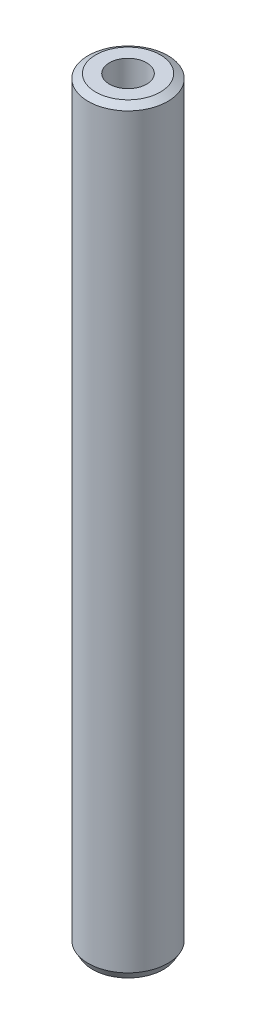
ISO-10303-21;
HEADER;
FILE_DESCRIPTION(('STEP AP214'),'2;1');
FILE_NAME('part.step','',(''),(''),'','','');
FILE_SCHEMA(('AUTOMOTIVE_DESIGN { 1 0 10303 214 1 1 1 1 }'));
ENDSEC;
DATA;
#1=APPLICATION_CONTEXT('core data for automotive mechanical design processes');
#2=APPLICATION_PROTOCOL_DEFINITION('international standard','automotive_design',2000,#1);
#3=PRODUCT_CONTEXT('',#1,'mechanical');
#4=PRODUCT('Part','Part','',(#3));
#5=PRODUCT_RELATED_PRODUCT_CATEGORY('part','',(#4));
#6=PRODUCT_DEFINITION_FORMATION('','',#4);
#7=PRODUCT_DEFINITION_CONTEXT('part definition',#1,'design');
#8=PRODUCT_DEFINITION('design','',#6,#7);
#9=PRODUCT_DEFINITION_SHAPE('','',#8);
#10=(LENGTH_UNIT() NAMED_UNIT(*) SI_UNIT(.MILLI.,.METRE.));
#11=(NAMED_UNIT(*) PLANE_ANGLE_UNIT() SI_UNIT($,.RADIAN.));
#12=(NAMED_UNIT(*) SI_UNIT($,.STERADIAN.) SOLID_ANGLE_UNIT());
#13=UNCERTAINTY_MEASURE_WITH_UNIT(LENGTH_MEASURE(1.E-05),#10,'distance_accuracy_value','');
#14=(GEOMETRIC_REPRESENTATION_CONTEXT(3) GLOBAL_UNCERTAINTY_ASSIGNED_CONTEXT((#13)) GLOBAL_UNIT_ASSIGNED_CONTEXT((#10,
#11,#12)) REPRESENTATION_CONTEXT('',''));
#15=CARTESIAN_POINT('',(0.,0.,0.));
#16=DIRECTION('',(0.,0.,1.));
#17=DIRECTION('',(1.,0.,0.));
#18=AXIS2_PLACEMENT_3D('',#15,#16,#17);
#19=CARTESIAN_POINT('',(0.,428.811424189461,0.));
#20=DIRECTION('',(0.,-1.,0.));
#21=DIRECTION('',(0.,0.,-1.));
#22=AXIS2_PLACEMENT_3D('',#19,#20,#21);
#23=CYLINDRICAL_SURFACE('',#22,22.5);
#24=CARTESIAN_POINT('',(0.,426.365814869016,0.));
#25=DIRECTION('',(0.,1.,0.));
#26=DIRECTION('',(0.,0.,1.));
#27=AXIS2_PLACEMENT_3D('',#24,#25,#26);
#28=CIRCLE('',#27,22.5);
#29=CARTESIAN_POINT('',(0.,426.365814869016,-22.5));
#30=VERTEX_POINT('',#29);
#31=EDGE_CURVE('E50',#30,#30,#28,.F.);
#32=CARTESIAN_POINT('',(0.,4.23591959847641,0.));
#33=DIRECTION('',(0.,1.,0.));
#34=DIRECTION('',(0.,0.,1.));
#35=AXIS2_PLACEMENT_3D('',#32,#33,#34);
#36=CIRCLE('',#35,22.5);
#37=CARTESIAN_POINT('',(0.,4.23591959847641,-22.5));
#38=VERTEX_POINT('',#37);
#39=EDGE_CURVE('E51',#38,#38,#36,.T.);
#40=CARTESIAN_POINT('',(0.,426.365814869016,-22.5));
#41=CARTESIAN_POINT('',(0.,421.968628459947,-22.5));
#42=CARTESIAN_POINT('',(0.,417.571442050879,-22.5));
#43=CARTESIAN_POINT('',(0.,408.777069232743,-22.5));
#44=CARTESIAN_POINT('',(0.,404.379882823675,-22.5));
#45=CARTESIAN_POINT('',(0.,395.585510005539,-22.5));
#46=CARTESIAN_POINT('',(0.,391.188323596471,-22.5));
#47=CARTESIAN_POINT('',(0.,382.393950778334,-22.5));
#48=CARTESIAN_POINT('',(0.,377.996764369266,-22.5));
#49=CARTESIAN_POINT('',(0.,369.20239155113,-22.5));
#50=CARTESIAN_POINT('',(0.,364.805205142062,-22.5));
#51=CARTESIAN_POINT('',(0.,356.010832323926,-22.5));
#52=CARTESIAN_POINT('',(0.,351.613645914858,-22.5));
#53=CARTESIAN_POINT('',(0.,342.819273096721,-22.5));
#54=CARTESIAN_POINT('',(0.,338.422086687653,-22.5));
#55=CARTESIAN_POINT('',(0.,329.627713869517,-22.5));
#56=CARTESIAN_POINT('',(0.,325.230527460449,-22.5));
#57=CARTESIAN_POINT('',(0.,316.436154642313,-22.5));
#58=CARTESIAN_POINT('',(0.,312.038968233245,-22.5));
#59=CARTESIAN_POINT('',(0.,303.244595415108,-22.5));
#60=CARTESIAN_POINT('',(0.,298.84740900604,-22.5));
#61=CARTESIAN_POINT('',(0.,290.053036187904,-22.5));
#62=CARTESIAN_POINT('',(0.,285.655849778836,-22.5));
#63=CARTESIAN_POINT('',(0.,276.8614769607,-22.5));
#64=CARTESIAN_POINT('',(0.,272.464290551632,-22.5));
#65=CARTESIAN_POINT('',(0.,263.669917733495,-22.5));
#66=CARTESIAN_POINT('',(0.,259.272731324427,-22.5));
#67=CARTESIAN_POINT('',(0.,250.478358506291,-22.5));
#68=CARTESIAN_POINT('',(0.,246.081172097223,-22.5));
#69=CARTESIAN_POINT('',(0.,237.286799279087,-22.5));
#70=CARTESIAN_POINT('',(0.,232.889612870018,-22.5));
#71=CARTESIAN_POINT('',(0.,224.095240051882,-22.5));
#72=CARTESIAN_POINT('',(0.,219.698053642814,-22.5));
#73=CARTESIAN_POINT('',(0.,210.903680824678,-22.5));
#74=CARTESIAN_POINT('',(0.,206.50649441561,-22.5));
#75=CARTESIAN_POINT('',(0.,197.712121597474,-22.5));
#76=CARTESIAN_POINT('',(0.,193.314935188405,-22.5));
#77=CARTESIAN_POINT('',(0.,184.520562370269,-22.5));
#78=CARTESIAN_POINT('',(0.,180.123375961201,-22.5));
#79=CARTESIAN_POINT('',(0.,171.329003143065,-22.5));
#80=CARTESIAN_POINT('',(0.,166.931816733997,-22.5));
#81=CARTESIAN_POINT('',(0.,158.137443915861,-22.5));
#82=CARTESIAN_POINT('',(0.,153.740257506792,-22.5));
#83=CARTESIAN_POINT('',(0.,144.945884688656,-22.5));
#84=CARTESIAN_POINT('',(0.,140.548698279588,-22.5));
#85=CARTESIAN_POINT('',(0.,131.754325461452,-22.5));
#86=CARTESIAN_POINT('',(0.,127.357139052384,-22.5));
#87=CARTESIAN_POINT('',(0.,118.562766234247,-22.5));
#88=CARTESIAN_POINT('',(0.,114.165579825179,-22.5));
#89=CARTESIAN_POINT('',(0.,105.371207007043,-22.5));
#90=CARTESIAN_POINT('',(0.,100.974020597975,-22.5));
#91=CARTESIAN_POINT('',(0.,92.1796477798387,-22.5));
#92=CARTESIAN_POINT('',(0.,87.7824613707706,-22.5));
#93=CARTESIAN_POINT('',(0.,78.9880885526344,-22.5));
#94=CARTESIAN_POINT('',(0.,74.5909021435663,-22.5));
#95=CARTESIAN_POINT('',(0.,65.79652932543,-22.5));
#96=CARTESIAN_POINT('',(0.,61.3993429163619,-22.5));
#97=CARTESIAN_POINT('',(0.,52.6049700982257,-22.5));
#98=CARTESIAN_POINT('',(0.,48.2077836891576,-22.5));
#99=CARTESIAN_POINT('',(0.,39.4134108710213,-22.5));
#100=CARTESIAN_POINT('',(0.,35.0162244619532,-22.5));
#101=CARTESIAN_POINT('',(0.,26.221851643817,-22.5));
#102=CARTESIAN_POINT('',(0.,21.8246652347489,-22.5));
#103=CARTESIAN_POINT('',(0.,13.0302924166126,-22.5));
#104=CARTESIAN_POINT('',(0.,8.63310600754451,-22.5));
#105=CARTESIAN_POINT('',(0.,4.23591959847641,-22.5));
#106=B_SPLINE_CURVE_WITH_KNOTS('',3,(#40,#41,#42,#43,#44,#45,#46,#47,#48,#49,#50,#51,#52,#53,
#54,#55,#56,#57,#58,#59,#60,#61,#62,#63,#64,#65,#66,#67,#68,#69,#70,#71,#72,#73,#74,#75,#76,#77,
#78,#79,#80,#81,#82,#83,#84,#85,#86,#87,#88,#89,#90,#91,#92,#93,#94,#95,#96,#97,#98,#99,#100,
#101,#102,#103,#104,#105),.UNSPECIFIED.,.F.,.F.,(4,2,2,2,2,2,2,2,2,2,2,2,2,2,2,2,2,2,2,2,2,2,2,
2,2,2,2,2,2,2,2,2,4),(0.,13.1915592272043,26.3831184544087,39.574677681613,52.7662369088174,
65.9577961360217,79.149355363226,92.3409145904304,105.532473817635,118.724033044839,
131.915592272043,145.107151499248,158.298710726452,171.490269953657,184.681829180861,
197.873388408065,211.06494763527,224.256506862474,237.448066089678,250.639625316883,
263.831184544087,277.022743771291,290.214302998496,303.4058622257,316.597421452904,
329.788980680109,342.980539907313,356.172099134517,369.363658361722,382.555217588926,
395.74677681613,408.938336043335,422.129895270539),.UNSPECIFIED.);
#107=EDGE_CURVE('BSEAM39',#30,#38,#106,.T.);
#108=ORIENTED_EDGE('',*,*,#31,.T.);
#109=ORIENTED_EDGE('',*,*,#39,.T.);
#110=ORIENTED_EDGE('',*,*,#107,.T.);
#111=ORIENTED_EDGE('',*,*,#107,.F.);
#112=EDGE_LOOP('',(#108,#110,#109,#111));
#113=FACE_BOUND('',#112,.T.);
#114=ADVANCED_FACE('F39',(#113),#23,.T.);
#115=CARTESIAN_POINT('',(0.,428.811424189461,0.));
#116=DIRECTION('',(0.,1.,0.));
#117=DIRECTION('',(0.,0.,1.));
#118=AXIS2_PLACEMENT_3D('',#115,#116,#117);
#119=PLANE('',#118);
#120=CARTESIAN_POINT('',(0.,428.811424189461,0.));
#121=DIRECTION('',(0.,1.,0.));
#122=DIRECTION('',(0.,0.,1.));
#123=AXIS2_PLACEMENT_3D('',#120,#121,#122);
#124=CIRCLE('',#123,18.2640804015243);
#125=CARTESIAN_POINT('',(0.,428.811424189461,18.2640804015243));
#126=VERTEX_POINT('',#125);
#127=EDGE_CURVE('E54',#126,#126,#124,.T.);
#128=ORIENTED_EDGE('',*,*,#127,.T.);
#129=EDGE_LOOP('',(#128));
#130=FACE_BOUND('',#129,.T.);
#131=CARTESIAN_POINT('',(0.,428.811424189461,0.));
#132=DIRECTION('',(0.,1.,0.));
#133=DIRECTION('',(0.,0.,1.));
#134=AXIS2_PLACEMENT_3D('',#131,#132,#133);
#135=CIRCLE('',#134,10.5264777317819);
#136=CARTESIAN_POINT('',(0.,428.811424189461,-10.5264777317819));
#137=VERTEX_POINT('',#136);
#138=EDGE_CURVE('E58',#137,#137,#135,.T.);
#139=ORIENTED_EDGE('',*,*,#138,.F.);
#140=EDGE_LOOP('',(#139));
#141=FACE_BOUND('',#140,.T.);
#142=ADVANCED_FACE('F69',(#130,#141),#119,.T.);
#143=CARTESIAN_POINT('',(0.,0.,0.));
#144=DIRECTION('',(0.,1.,0.));
#145=DIRECTION('',(0.,0.,1.));
#146=AXIS2_PLACEMENT_3D('',#143,#144,#145);
#147=PLANE('',#146);
#148=CARTESIAN_POINT('',(0.,0.,0.));
#149=DIRECTION('',(0.,1.,0.));
#150=DIRECTION('',(0.,0.,1.));
#151=AXIS2_PLACEMENT_3D('',#148,#149,#150);
#152=CIRCLE('',#151,20.054390679554);
#153=CARTESIAN_POINT('',(0.,0.,20.054390679554));
#154=VERTEX_POINT('',#153);
#155=EDGE_CURVE('E10',#154,#154,#152,.F.);
#156=ORIENTED_EDGE('',*,*,#155,.T.);
#157=EDGE_LOOP('',(#156));
#158=FACE_BOUND('',#157,.T.);
#159=CARTESIAN_POINT('',(0.,0.,0.));
#160=DIRECTION('',(0.,1.,0.));
#161=DIRECTION('',(0.,0.,1.));
#162=AXIS2_PLACEMENT_3D('',#159,#160,#161);
#163=CIRCLE('',#162,10.5264777317819);
#164=CARTESIAN_POINT('',(0.,0.,-10.5264777317819));
#165=VERTEX_POINT('',#164);
#166=EDGE_CURVE('E63',#165,#165,#163,.T.);
#167=ORIENTED_EDGE('',*,*,#166,.T.);
#168=EDGE_LOOP('',(#167));
#169=FACE_BOUND('',#168,.T.);
#170=ADVANCED_FACE('F75',(#158,#169),#147,.F.);
#171=CARTESIAN_POINT('',(0.,428.811424189461,0.));
#172=DIRECTION('',(0.,-1.,0.));
#173=DIRECTION('',(0.,0.,-1.));
#174=AXIS2_PLACEMENT_3D('',#171,#172,#173);
#175=CYLINDRICAL_SURFACE('',#174,10.5264777317819);
#176=CARTESIAN_POINT('',(0.,428.811424189461,-10.5264777317819));
#177=CARTESIAN_POINT('',(0.,424.344638520821,-10.5264777317819));
#178=CARTESIAN_POINT('',(0.,419.877852852181,-10.5264777317819));
#179=CARTESIAN_POINT('',(0.,410.9442815149,-10.5264777317819));
#180=CARTESIAN_POINT('',(0.,406.47749584626,-10.5264777317819));
#181=CARTESIAN_POINT('',(0.,397.54392450898,-10.5264777317819));
#182=CARTESIAN_POINT('',(0.,393.077138840339,-10.5264777317819));
#183=CARTESIAN_POINT('',(0.,384.143567503059,-10.5264777317819));
#184=CARTESIAN_POINT('',(0.,379.676781834419,-10.5264777317819));
#185=CARTESIAN_POINT('',(0.,370.743210497138,-10.5264777317819));
#186=CARTESIAN_POINT('',(0.,366.276424828498,-10.5264777317819));
#187=CARTESIAN_POINT('',(0.,357.342853491218,-10.5264777317819));
#188=CARTESIAN_POINT('',(0.,352.876067822577,-10.5264777317819));
#189=CARTESIAN_POINT('',(0.,343.942496485297,-10.5264777317819));
#190=CARTESIAN_POINT('',(0.,339.475710816657,-10.5264777317819));
#191=CARTESIAN_POINT('',(0.,330.542139479376,-10.5264777317819));
#192=CARTESIAN_POINT('',(0.,326.075353810736,-10.5264777317819));
#193=CARTESIAN_POINT('',(0.,317.141782473456,-10.5264777317819));
#194=CARTESIAN_POINT('',(0.,312.674996804815,-10.5264777317819));
#195=CARTESIAN_POINT('',(0.,303.741425467535,-10.5264777317819));
#196=CARTESIAN_POINT('',(0.,299.274639798895,-10.5264777317819));
#197=CARTESIAN_POINT('',(0.,290.341068461614,-10.5264777317819));
#198=CARTESIAN_POINT('',(0.,285.874282792974,-10.5264777317819));
#199=CARTESIAN_POINT('',(0.,276.940711455694,-10.5264777317819));
#200=CARTESIAN_POINT('',(0.,272.473925787053,-10.5264777317819));
#201=CARTESIAN_POINT('',(0.,263.540354449773,-10.5264777317819));
#202=CARTESIAN_POINT('',(0.,259.073568781133,-10.5264777317819));
#203=CARTESIAN_POINT('',(0.,250.139997443852,-10.5264777317819));
#204=CARTESIAN_POINT('',(0.,245.673211775212,-10.5264777317819));
#205=CARTESIAN_POINT('',(0.,236.739640437932,-10.5264777317819));
#206=CARTESIAN_POINT('',(0.,232.272854769291,-10.5264777317819));
#207=CARTESIAN_POINT('',(0.,223.339283432011,-10.5264777317819));
#208=CARTESIAN_POINT('',(0.,218.872497763371,-10.5264777317819));
#209=CARTESIAN_POINT('',(0.,209.93892642609,-10.5264777317819));
#210=CARTESIAN_POINT('',(0.,205.47214075745,-10.5264777317819));
#211=CARTESIAN_POINT('',(0.,196.53856942017,-10.5264777317819));
#212=CARTESIAN_POINT('',(0.,192.071783751529,-10.5264777317819));
#213=CARTESIAN_POINT('',(0.,183.138212414249,-10.5264777317819));
#214=CARTESIAN_POINT('',(0.,178.671426745609,-10.5264777317819));
#215=CARTESIAN_POINT('',(0.,169.737855408328,-10.5264777317819));
#216=CARTESIAN_POINT('',(0.,165.271069739688,-10.5264777317819));
#217=CARTESIAN_POINT('',(0.,156.337498402408,-10.5264777317819));
#218=CARTESIAN_POINT('',(0.,151.870712733767,-10.5264777317819));
#219=CARTESIAN_POINT('',(0.,142.937141396487,-10.5264777317819));
#220=CARTESIAN_POINT('',(0.,138.470355727847,-10.5264777317819));
#221=CARTESIAN_POINT('',(0.,129.536784390566,-10.5264777317819));
#222=CARTESIAN_POINT('',(0.,125.069998721926,-10.5264777317819));
#223=CARTESIAN_POINT('',(0.,116.136427384646,-10.5264777317819));
#224=CARTESIAN_POINT('',(0.,111.669641716006,-10.5264777317819));
#225=CARTESIAN_POINT('',(0.,102.736070378725,-10.5264777317819));
#226=CARTESIAN_POINT('',(0.,98.2692847100848,-10.5264777317819));
#227=CARTESIAN_POINT('',(0.,89.3357133728044,-10.5264777317819));
#228=CARTESIAN_POINT('',(0.,84.8689277041642,-10.5264777317819));
#229=CARTESIAN_POINT('',(0.,75.9353563668837,-10.5264777317819));
#230=CARTESIAN_POINT('',(0.,71.4685706982435,-10.5264777317819));
#231=CARTESIAN_POINT('',(0.,62.534999360963,-10.5264777317819));
#232=CARTESIAN_POINT('',(0.,58.0682136923228,-10.5264777317819));
#233=CARTESIAN_POINT('',(0.,49.1346423550424,-10.5264777317819));
#234=CARTESIAN_POINT('',(0.,44.6678566864022,-10.5264777317819));
#235=CARTESIAN_POINT('',(0.,35.7342853491217,-10.5264777317819));
#236=CARTESIAN_POINT('',(0.,31.2674996804815,-10.5264777317819));
#237=CARTESIAN_POINT('',(0.,22.333928343201,-10.5264777317819));
#238=CARTESIAN_POINT('',(0.,17.8671426745608,-10.5264777317819));
#239=CARTESIAN_POINT('',(0.,8.9335713372804,-10.5264777317819));
#240=CARTESIAN_POINT('',(0.,4.46678566864017,-10.5264777317819));
#241=CARTESIAN_POINT('',(0.,0.,-10.5264777317819));
#242=B_SPLINE_CURVE_WITH_KNOTS('',3,(#176,#177,#178,#179,#180,#181,#182,#183,#184,#185,#186,
#187,#188,#189,#190,#191,#192,#193,#194,#195,#196,#197,#198,#199,#200,#201,#202,#203,#204,#205,
#206,#207,#208,#209,#210,#211,#212,#213,#214,#215,#216,#217,#218,#219,#220,#221,#222,#223,#224,
#225,#226,#227,#228,#229,#230,#231,#232,#233,#234,#235,#236,#237,#238,#239,#240,#241),
.UNSPECIFIED.,.F.,.F.,(4,2,2,2,2,2,2,2,2,2,2,2,2,2,2,2,2,2,2,2,2,2,2,2,2,2,2,2,2,2,2,2,4),(0.,
13.4003570059207,26.8007140118414,40.201071017762,53.6014280236827,67.0017850296034,
80.402142035524,93.8024990414447,107.202856047365,120.603213053286,134.003570059207,
147.403927065127,160.804284071048,174.204641076969,187.604998082889,201.00535508881,
214.405712094731,227.806069100651,241.206426106572,254.606783112493,268.007140118413,
281.407497124334,294.807854130255,308.208211136175,321.608568142096,335.008925148017,
348.409282153937,361.809639159858,375.209996165779,388.610353171699,402.01071017762,
415.411067183541,428.811424189461),.UNSPECIFIED.);
#243=EDGE_CURVE('BSEAM70',#137,#165,#242,.T.);
#244=ORIENTED_EDGE('',*,*,#138,.T.);
#245=ORIENTED_EDGE('',*,*,#166,.F.);
#246=ORIENTED_EDGE('',*,*,#243,.T.);
#247=ORIENTED_EDGE('',*,*,#243,.F.);
#248=EDGE_LOOP('',(#244,#246,#245,#247));
#249=FACE_BOUND('',#248,.T.);
#250=ADVANCED_FACE('F70',(#249),#175,.F.);
#251=CARTESIAN_POINT('',(0.,428.811424189461,0.));
#252=DIRECTION('',(0.,-1.,0.));
#253=DIRECTION('',(0.,0.,-1.));
#254=AXIS2_PLACEMENT_3D('',#251,#252,#253);
#255=CONICAL_SURFACE('',#254,18.2640804015243,1.04719755119659);
#256=ORIENTED_EDGE('',*,*,#31,.F.);
#257=EDGE_LOOP('',(#256));
#258=FACE_BOUND('',#257,.T.);
#259=ORIENTED_EDGE('',*,*,#127,.F.);
#260=EDGE_LOOP('',(#259));
#261=FACE_BOUND('',#260,.T.);
#262=ADVANCED_FACE('F81',(#258,#261),#255,.T.);
#263=CARTESIAN_POINT('',(0.,4.23591959847641,0.));
#264=DIRECTION('',(0.,1.,0.));
#265=DIRECTION('',(0.,0.,1.));
#266=AXIS2_PLACEMENT_3D('',#263,#264,#265);
#267=CONICAL_SURFACE('',#266,22.5,0.5235987755983);
#268=ORIENTED_EDGE('',*,*,#155,.F.);
#269=EDGE_LOOP('',(#268));
#270=FACE_BOUND('',#269,.T.);
#271=ORIENTED_EDGE('',*,*,#39,.F.);
#272=EDGE_LOOP('',(#271));
#273=FACE_BOUND('',#272,.T.);
#274=ADVANCED_FACE('F45',(#270,#273),#267,.T.);
#275=CLOSED_SHELL('',(#114,#142,#170,#250,#262,#274));
#276=MANIFOLD_SOLID_BREP('B2',#275);
#277=ADVANCED_BREP_SHAPE_REPRESENTATION('',(#18,#276),#14);
#278=SHAPE_DEFINITION_REPRESENTATION(#9,#277);
ENDSEC;
END-ISO-10303-21;
